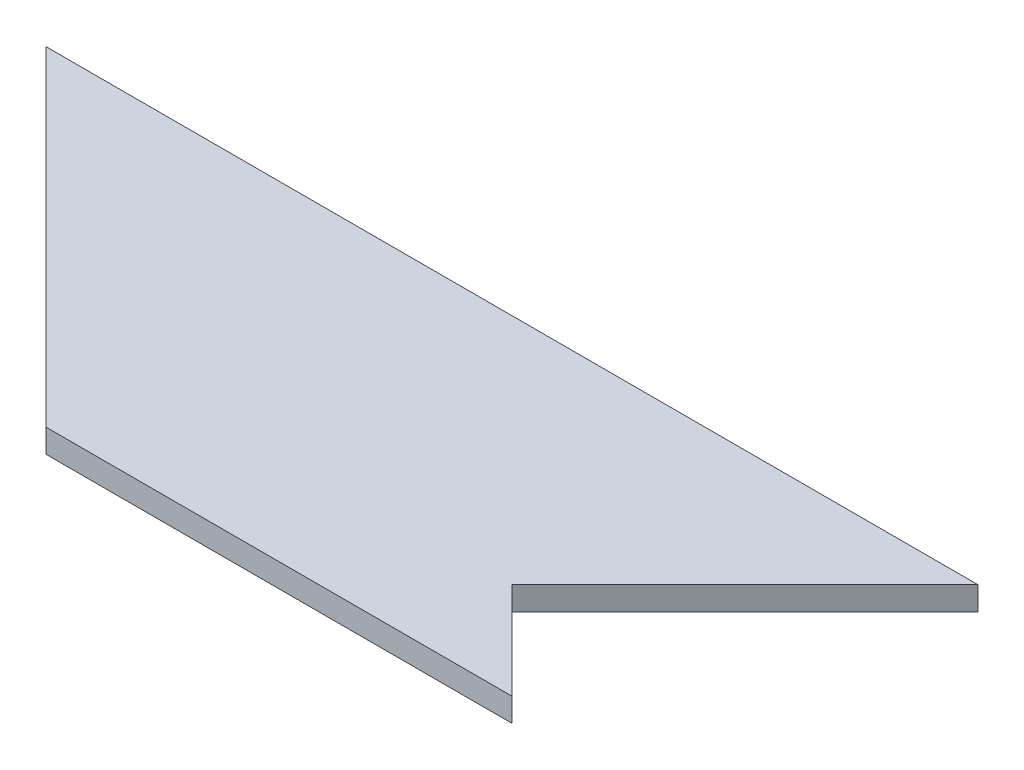
ISO-10303-21;
HEADER;
FILE_DESCRIPTION(('STEP AP214'),'2;1');
FILE_NAME('part.step','',(''),(''),'','','');
FILE_SCHEMA(('AUTOMOTIVE_DESIGN { 1 0 10303 214 1 1 1 1 }'));
ENDSEC;
DATA;
#1=APPLICATION_CONTEXT('core data for automotive mechanical design processes');
#2=APPLICATION_PROTOCOL_DEFINITION('international standard','automotive_design',2000,#1);
#3=PRODUCT_CONTEXT('',#1,'mechanical');
#4=PRODUCT('Part','Part','',(#3));
#5=PRODUCT_RELATED_PRODUCT_CATEGORY('part','',(#4));
#6=PRODUCT_DEFINITION_FORMATION('','',#4);
#7=PRODUCT_DEFINITION_CONTEXT('part definition',#1,'design');
#8=PRODUCT_DEFINITION('design','',#6,#7);
#9=PRODUCT_DEFINITION_SHAPE('','',#8);
#10=(LENGTH_UNIT() NAMED_UNIT(*) SI_UNIT(.MILLI.,.METRE.));
#11=(NAMED_UNIT(*) PLANE_ANGLE_UNIT() SI_UNIT($,.RADIAN.));
#12=(NAMED_UNIT(*) SI_UNIT($,.STERADIAN.) SOLID_ANGLE_UNIT());
#13=UNCERTAINTY_MEASURE_WITH_UNIT(LENGTH_MEASURE(1.E-05),#10,'distance_accuracy_value','');
#14=(GEOMETRIC_REPRESENTATION_CONTEXT(3) GLOBAL_UNCERTAINTY_ASSIGNED_CONTEXT((#13)) GLOBAL_UNIT_ASSIGNED_CONTEXT((#10,
#11,#12)) REPRESENTATION_CONTEXT('',''));
#15=CARTESIAN_POINT('',(0.,0.,0.));
#16=DIRECTION('',(0.,0.,1.));
#17=DIRECTION('',(1.,0.,0.));
#18=AXIS2_PLACEMENT_3D('',#15,#16,#17);
#19=CARTESIAN_POINT('',(-59.4,3.,-16.2378504672897));
#20=DIRECTION('',(0.,0.,1.));
#21=DIRECTION('',(1.,0.,0.));
#22=AXIS2_PLACEMENT_3D('',#19,#20,#21);
#23=PLANE('',#22);
#24=DIRECTION('',(-1.,0.,0.));
#25=VECTOR('',#24,1.);
#26=CARTESIAN_POINT('',(-59.4,0.,-16.2378504672897));
#27=LINE('',#26,#25);
#28=CARTESIAN_POINT('',(59.4,0.,-16.2378504672897));
#29=VERTEX_POINT('',#28);
#30=CARTESIAN_POINT('',(-59.4,0.,-16.2378504672897));
#31=VERTEX_POINT('',#30);
#32=EDGE_CURVE('E107',#29,#31,#27,.T.);
#33=ORIENTED_EDGE('',*,*,#32,.T.);
#34=DIRECTION('',(0.,-1.,0.));
#35=VECTOR('',#34,1.);
#36=CARTESIAN_POINT('',(-59.4,3.,-16.2378504672897));
#37=LINE('',#36,#35);
#38=CARTESIAN_POINT('',(-59.4,3.,-16.2378504672897));
#39=VERTEX_POINT('',#38);
#40=EDGE_CURVE('E11',#39,#31,#37,.T.);
#41=ORIENTED_EDGE('',*,*,#40,.F.);
#42=DIRECTION('',(-1.,0.,0.));
#43=VECTOR('',#42,1.);
#44=CARTESIAN_POINT('',(-59.4,3.,-16.2378504672897));
#45=LINE('',#44,#43);
#46=CARTESIAN_POINT('',(59.4,3.,-16.2378504672897));
#47=VERTEX_POINT('',#46);
#48=EDGE_CURVE('E115',#47,#39,#45,.T.);
#49=ORIENTED_EDGE('',*,*,#48,.F.);
#50=DIRECTION('',(0.,-1.,0.));
#51=VECTOR('',#50,1.);
#52=CARTESIAN_POINT('',(59.4,3.,-16.2378504672897));
#53=LINE('',#52,#51);
#54=EDGE_CURVE('E103',#47,#29,#53,.T.);
#55=ORIENTED_EDGE('',*,*,#54,.T.);
#56=EDGE_LOOP('',(#33,#41,#49,#55));
#57=FACE_BOUND('',#56,.T.);
#58=ADVANCED_FACE('F33',(#57),#23,.F.);
#59=CARTESIAN_POINT('',(-59.4,3.,-16.2378504672897));
#60=DIRECTION('',(0.707106781186549,0.,-0.707106781186546));
#61=DIRECTION('',(-0.707106781186546,0.,-0.707106781186549));
#62=AXIS2_PLACEMENT_3D('',#59,#60,#61);
#63=PLANE('',#62);
#64=DIRECTION('',(0.707106781186546,0.,0.707106781186549));
#65=VECTOR('',#64,1.);
#66=CARTESIAN_POINT('',(-59.4,0.,-16.2378504672897));
#67=LINE('',#66,#65);
#68=CARTESIAN_POINT('',(-17.3978571975192,0.,25.7642923351913));
#69=VERTEX_POINT('',#68);
#70=EDGE_CURVE('E110',#31,#69,#67,.T.);
#71=ORIENTED_EDGE('',*,*,#70,.T.);
#72=DIRECTION('',(0.,-1.,0.));
#73=VECTOR('',#72,1.);
#74=CARTESIAN_POINT('',(-17.3978571975192,3.,25.7642923351913));
#75=LINE('',#74,#73);
#76=CARTESIAN_POINT('',(-17.3978571975192,3.,25.7642923351913));
#77=VERTEX_POINT('',#76);
#78=EDGE_CURVE('E41',#77,#69,#75,.T.);
#79=ORIENTED_EDGE('',*,*,#78,.F.);
#80=DIRECTION('',(0.707106781186546,0.,0.707106781186549));
#81=VECTOR('',#80,1.);
#82=CARTESIAN_POINT('',(-59.4,3.,-16.2378504672897));
#83=LINE('',#82,#81);
#84=EDGE_CURVE('E83',#39,#77,#83,.T.);
#85=ORIENTED_EDGE('',*,*,#84,.F.);
#86=ORIENTED_EDGE('',*,*,#40,.T.);
#87=EDGE_LOOP('',(#71,#79,#85,#86));
#88=FACE_BOUND('',#87,.T.);
#89=ADVANCED_FACE('F134',(#88),#63,.F.);
#90=CARTESIAN_POINT('',(-17.3978571975192,3.,25.7642923351913));
#91=DIRECTION('',(0.,0.,-1.));
#92=DIRECTION('',(-1.,0.,0.));
#93=AXIS2_PLACEMENT_3D('',#90,#91,#92);
#94=PLANE('',#93);
#95=DIRECTION('',(1.,0.,0.));
#96=VECTOR('',#95,1.);
#97=CARTESIAN_POINT('',(-17.3978571975192,0.,25.7642923351913));
#98=LINE('',#97,#96);
#99=CARTESIAN_POINT('',(42.0021428024809,0.,25.7642923351913));
#100=VERTEX_POINT('',#99);
#101=EDGE_CURVE('E98',#69,#100,#98,.T.);
#102=ORIENTED_EDGE('',*,*,#101,.T.);
#103=DIRECTION('',(0.,-1.,0.));
#104=VECTOR('',#103,1.);
#105=CARTESIAN_POINT('',(42.0021428024809,3.,25.7642923351913));
#106=LINE('',#105,#104);
#107=CARTESIAN_POINT('',(42.0021428024809,3.,25.7642923351913));
#108=VERTEX_POINT('',#107);
#109=EDGE_CURVE('E95',#108,#100,#106,.T.);
#110=ORIENTED_EDGE('',*,*,#109,.F.);
#111=DIRECTION('',(1.,0.,0.));
#112=VECTOR('',#111,1.);
#113=CARTESIAN_POINT('',(-17.3978571975192,3.,25.7642923351913));
#114=LINE('',#113,#112);
#115=EDGE_CURVE('E87',#77,#108,#114,.T.);
#116=ORIENTED_EDGE('',*,*,#115,.F.);
#117=ORIENTED_EDGE('',*,*,#78,.T.);
#118=EDGE_LOOP('',(#102,#110,#116,#117));
#119=FACE_BOUND('',#118,.T.);
#120=ADVANCED_FACE('F96',(#119),#94,.F.);
#121=CARTESIAN_POINT('',(29.7015151901649,3.,13.4606343425451));
#122=DIRECTION('',(-0.707193866442357,0.,0.707019685204245));
#123=DIRECTION('',(0.707019685204245,0.,0.707193866442357));
#124=AXIS2_PLACEMENT_3D('',#121,#122,#123);
#125=PLANE('',#124);
#126=DIRECTION('',(-0.707019685204245,0.,-0.707193866442357));
#127=VECTOR('',#126,1.);
#128=CARTESIAN_POINT('',(29.7015151901649,0.,13.4606343425451));
#129=LINE('',#128,#127);
#130=CARTESIAN_POINT('',(29.7015151901649,0.,13.4606343425451));
#131=VERTEX_POINT('',#130);
#132=EDGE_CURVE('E69',#100,#131,#129,.T.);
#133=ORIENTED_EDGE('',*,*,#132,.T.);
#134=DIRECTION('',(0.,-1.,0.));
#135=VECTOR('',#134,1.);
#136=CARTESIAN_POINT('',(29.7015151901649,3.,13.4606343425451));
#137=LINE('',#136,#135);
#138=CARTESIAN_POINT('',(29.7015151901649,3.,13.4606343425451));
#139=VERTEX_POINT('',#138);
#140=EDGE_CURVE('E99',#139,#131,#137,.T.);
#141=ORIENTED_EDGE('',*,*,#140,.F.);
#142=DIRECTION('',(-0.707019685204245,0.,-0.707193866442357));
#143=VECTOR('',#142,1.);
#144=CARTESIAN_POINT('',(29.7015151901649,3.,13.4606343425451));
#145=LINE('',#144,#143);
#146=EDGE_CURVE('E91',#108,#139,#145,.T.);
#147=ORIENTED_EDGE('',*,*,#146,.F.);
#148=ORIENTED_EDGE('',*,*,#109,.T.);
#149=EDGE_LOOP('',(#133,#141,#147,#148));
#150=FACE_BOUND('',#149,.T.);
#151=ADVANCED_FACE('F101',(#150),#125,.F.);
#152=CARTESIAN_POINT('',(59.4,3.,-16.2378504672897));
#153=DIRECTION('',(-0.707106781186544,0.,-0.707106781186551));
#154=DIRECTION('',(-0.707106781186551,0.,0.707106781186544));
#155=AXIS2_PLACEMENT_3D('',#152,#153,#154);
#156=PLANE('',#155);
#157=DIRECTION('',(0.707106781186551,0.,-0.707106781186544));
#158=VECTOR('',#157,1.);
#159=CARTESIAN_POINT('',(59.4,0.,-16.2378504672897));
#160=LINE('',#159,#158);
#161=EDGE_CURVE('E75',#131,#29,#160,.T.);
#162=ORIENTED_EDGE('',*,*,#161,.T.);
#163=ORIENTED_EDGE('',*,*,#54,.F.);
#164=DIRECTION('',(0.707106781186551,0.,-0.707106781186544));
#165=VECTOR('',#164,1.);
#166=CARTESIAN_POINT('',(59.4,3.,-16.2378504672897));
#167=LINE('',#166,#165);
#168=EDGE_CURVE('E49',#139,#47,#167,.T.);
#169=ORIENTED_EDGE('',*,*,#168,.F.);
#170=ORIENTED_EDGE('',*,*,#140,.T.);
#171=EDGE_LOOP('',(#162,#163,#169,#170));
#172=FACE_BOUND('',#171,.T.);
#173=ADVANCED_FACE('F123',(#172),#156,.F.);
#174=CARTESIAN_POINT('',(0.,3.,0.));
#175=DIRECTION('',(0.,-1.,0.));
#176=DIRECTION('',(0.,0.,-1.));
#177=AXIS2_PLACEMENT_3D('',#174,#175,#176);
#178=PLANE('',#177);
#179=ORIENTED_EDGE('',*,*,#48,.T.);
#180=ORIENTED_EDGE('',*,*,#84,.T.);
#181=ORIENTED_EDGE('',*,*,#115,.T.);
#182=ORIENTED_EDGE('',*,*,#146,.T.);
#183=ORIENTED_EDGE('',*,*,#168,.T.);
#184=EDGE_LOOP('',(#179,#180,#181,#182,#183));
#185=FACE_BOUND('',#184,.T.);
#186=ADVANCED_FACE('F89',(#185),#178,.F.);
#187=CARTESIAN_POINT('',(0.,0.,0.));
#188=DIRECTION('',(0.,-1.,0.));
#189=DIRECTION('',(0.,0.,-1.));
#190=AXIS2_PLACEMENT_3D('',#187,#188,#189);
#191=PLANE('',#190);
#192=ORIENTED_EDGE('',*,*,#32,.F.);
#193=ORIENTED_EDGE('',*,*,#161,.F.);
#194=ORIENTED_EDGE('',*,*,#132,.F.);
#195=ORIENTED_EDGE('',*,*,#101,.F.);
#196=ORIENTED_EDGE('',*,*,#70,.F.);
#197=EDGE_LOOP('',(#192,#193,#194,#195,#196));
#198=FACE_BOUND('',#197,.T.);
#199=ADVANCED_FACE('F119',(#198),#191,.T.);
#200=CLOSED_SHELL('',(#58,#89,#120,#151,#173,#186,#199));
#201=MANIFOLD_SOLID_BREP('B2',#200);
#202=ADVANCED_BREP_SHAPE_REPRESENTATION('',(#18,#201),#14);
#203=SHAPE_DEFINITION_REPRESENTATION(#9,#202);
ENDSEC;
END-ISO-10303-21;
